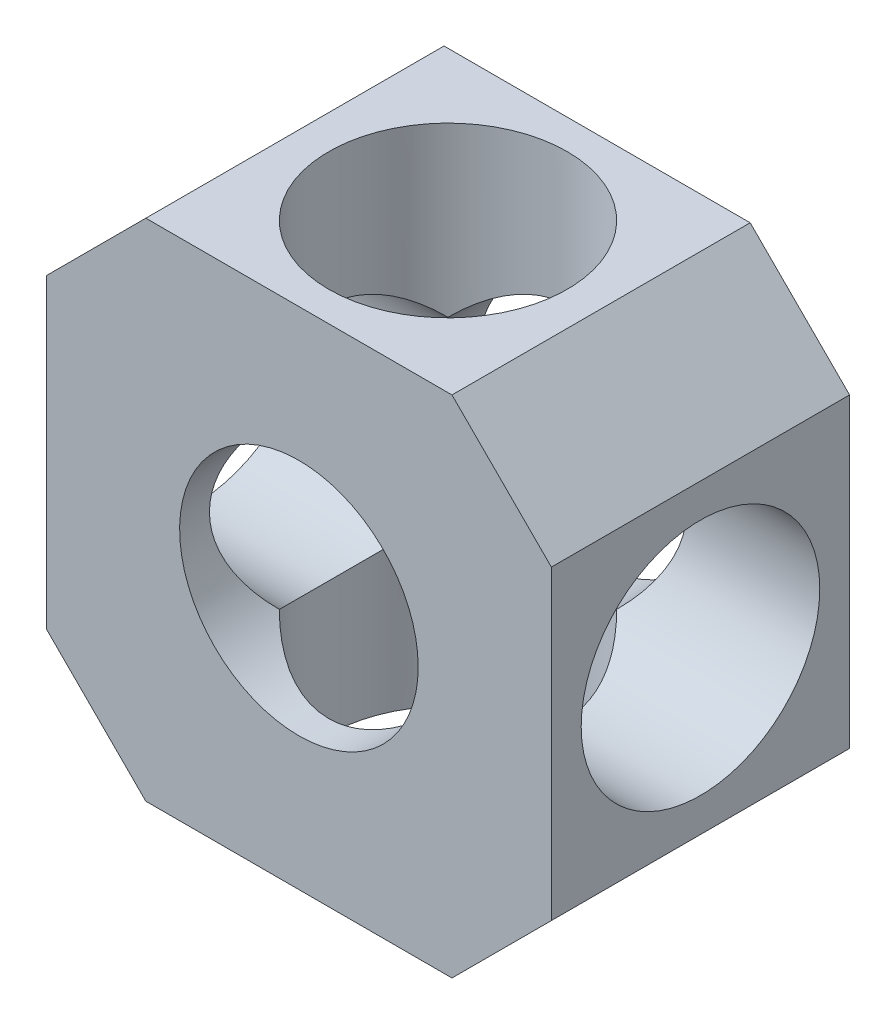
ISO-10303-21;
HEADER;
FILE_DESCRIPTION(('STEP AP214'),'2;1');
FILE_NAME('part.step','',(''),(''),'','','');
FILE_SCHEMA(('AUTOMOTIVE_DESIGN { 1 0 10303 214 1 1 1 1 }'));
ENDSEC;
DATA;
#1=APPLICATION_CONTEXT('core data for automotive mechanical design processes');
#2=APPLICATION_PROTOCOL_DEFINITION('international standard','automotive_design',2000,#1);
#3=PRODUCT_CONTEXT('',#1,'mechanical');
#4=PRODUCT('Part','Part','',(#3));
#5=PRODUCT_RELATED_PRODUCT_CATEGORY('part','',(#4));
#6=PRODUCT_DEFINITION_FORMATION('','',#4);
#7=PRODUCT_DEFINITION_CONTEXT('part definition',#1,'design');
#8=PRODUCT_DEFINITION('design','',#6,#7);
#9=PRODUCT_DEFINITION_SHAPE('','',#8);
#10=(LENGTH_UNIT() NAMED_UNIT(*) SI_UNIT(.MILLI.,.METRE.));
#11=(NAMED_UNIT(*) PLANE_ANGLE_UNIT() SI_UNIT($,.RADIAN.));
#12=(NAMED_UNIT(*) SI_UNIT($,.STERADIAN.) SOLID_ANGLE_UNIT());
#13=UNCERTAINTY_MEASURE_WITH_UNIT(LENGTH_MEASURE(1.E-05),#10,'distance_accuracy_value','');
#14=(GEOMETRIC_REPRESENTATION_CONTEXT(3) GLOBAL_UNCERTAINTY_ASSIGNED_CONTEXT((#13)) GLOBAL_UNIT_ASSIGNED_CONTEXT((#10,
#11,#12)) REPRESENTATION_CONTEXT('',''));
#15=CARTESIAN_POINT('',(0.,0.,0.));
#16=DIRECTION('',(0.,0.,1.));
#17=DIRECTION('',(1.,0.,0.));
#18=AXIS2_PLACEMENT_3D('',#15,#16,#17);
#19=CARTESIAN_POINT('',(12.7,12.7,15.));
#20=DIRECTION('',(0.,0.,-1.));
#21=DIRECTION('',(-1.,0.,0.));
#22=AXIS2_PLACEMENT_3D('',#19,#20,#21);
#23=CYLINDRICAL_SURFACE('',#22,6.);
#24=CARTESIAN_POINT('',(12.7,12.7,7.5));
#25=DIRECTION('',(0.,0.707106781186547,-0.707106781186547));
#26=DIRECTION('',(0.,-0.707106781186547,-0.707106781186547));
#27=AXIS2_PLACEMENT_3D('',#24,#25,#26);
#28=ELLIPSE('',#27,8.48528137423857,6.);
#29=CARTESIAN_POINT('',(16.9426406871193,16.9426406871193,11.7426406871193));
#30=VERTEX_POINT('',#29);
#31=CARTESIAN_POINT('',(8.45735931288072,16.9426406871193,11.7426406871193));
#32=VERTEX_POINT('',#31);
#33=EDGE_CURVE('E127',#30,#32,#28,.F.);
#34=ORIENTED_EDGE('',*,*,#33,.F.);
#35=CARTESIAN_POINT('',(12.7,12.7,7.5));
#36=DIRECTION('',(0.707106781186547,0.,-0.707106781186547));
#37=DIRECTION('',(-0.707106781186547,0.,-0.707106781186547));
#38=AXIS2_PLACEMENT_3D('',#35,#36,#37);
#39=ELLIPSE('',#38,8.48528137423857,6.);
#40=CARTESIAN_POINT('',(16.9426406871193,8.45735931288072,11.7426406871193));
#41=VERTEX_POINT('',#40);
#42=EDGE_CURVE('E134',#41,#30,#39,.F.);
#43=ORIENTED_EDGE('',*,*,#42,.F.);
#44=CARTESIAN_POINT('',(12.7,12.7,7.5));
#45=DIRECTION('',(0.,-0.707106781186547,-0.707106781186547));
#46=DIRECTION('',(0.,0.707106781186547,-0.707106781186547));
#47=AXIS2_PLACEMENT_3D('',#44,#45,#46);
#48=ELLIPSE('',#47,8.48528137423857,6.);
#49=CARTESIAN_POINT('',(8.45735931288072,8.45735931288072,11.7426406871193));
#50=VERTEX_POINT('',#49);
#51=EDGE_CURVE('E63',#50,#41,#48,.F.);
#52=ORIENTED_EDGE('',*,*,#51,.F.);
#53=CARTESIAN_POINT('',(12.7,12.7,7.5));
#54=DIRECTION('',(-0.707106781186547,0.,-0.707106781186547));
#55=DIRECTION('',(0.707106781186547,0.,-0.707106781186547));
#56=AXIS2_PLACEMENT_3D('',#53,#54,#55);
#57=ELLIPSE('',#56,8.48528137423857,6.);
#58=EDGE_CURVE('E140',#32,#50,#57,.F.);
#59=ORIENTED_EDGE('',*,*,#58,.F.);
#60=EDGE_LOOP('',(#34,#43,#52,#59));
#61=FACE_BOUND('',#60,.T.);
#62=CARTESIAN_POINT('',(12.7,12.7,15.));
#63=DIRECTION('',(0.,0.,1.));
#64=DIRECTION('',(1.,0.,0.));
#65=AXIS2_PLACEMENT_3D('',#62,#63,#64);
#66=CIRCLE('',#65,6.);
#67=CARTESIAN_POINT('',(18.7,12.7,15.));
#68=VERTEX_POINT('',#67);
#69=EDGE_CURVE('E217',#68,#68,#66,.T.);
#70=ORIENTED_EDGE('',*,*,#69,.T.);
#71=EDGE_LOOP('',(#70));
#72=FACE_BOUND('',#71,.T.);
#73=ADVANCED_FACE('F39',(#61,#72),#23,.F.);
#74=CARTESIAN_POINT('',(0.,0.,15.));
#75=DIRECTION('',(0.,0.,-1.));
#76=DIRECTION('',(-1.,0.,0.));
#77=AXIS2_PLACEMENT_3D('',#74,#75,#76);
#78=PLANE('',#77);
#79=DIRECTION('',(0.,-1.,0.));
#80=VECTOR('',#79,1.);
#81=CARTESIAN_POINT('',(0.,5.,15.));
#82=LINE('',#81,#80);
#83=CARTESIAN_POINT('',(0.,20.4,15.));
#84=VERTEX_POINT('',#83);
#85=CARTESIAN_POINT('',(0.,5.,15.));
#86=VERTEX_POINT('',#85);
#87=EDGE_CURVE('E194',#84,#86,#82,.T.);
#88=ORIENTED_EDGE('',*,*,#87,.T.);
#89=DIRECTION('',(0.707106781186548,-0.707106781186548,0.));
#90=VECTOR('',#89,1.);
#91=CARTESIAN_POINT('',(0.,5.,15.));
#92=LINE('',#91,#90);
#93=CARTESIAN_POINT('',(5.,0.,15.));
#94=VERTEX_POINT('',#93);
#95=EDGE_CURVE('E235',#86,#94,#92,.T.);
#96=ORIENTED_EDGE('',*,*,#95,.T.);
#97=DIRECTION('',(1.,0.,0.));
#98=VECTOR('',#97,1.);
#99=CARTESIAN_POINT('',(5.,0.,15.));
#100=LINE('',#99,#98);
#101=CARTESIAN_POINT('',(20.4,0.,15.));
#102=VERTEX_POINT('',#101);
#103=EDGE_CURVE('E232',#94,#102,#100,.T.);
#104=ORIENTED_EDGE('',*,*,#103,.T.);
#105=DIRECTION('',(0.707106781186548,0.707106781186547,0.));
#106=VECTOR('',#105,1.);
#107=CARTESIAN_POINT('',(20.4,0.,15.));
#108=LINE('',#107,#106);
#109=CARTESIAN_POINT('',(25.4,5.,15.));
#110=VERTEX_POINT('',#109);
#111=EDGE_CURVE('E229',#102,#110,#108,.T.);
#112=ORIENTED_EDGE('',*,*,#111,.T.);
#113=DIRECTION('',(0.,1.,0.));
#114=VECTOR('',#113,1.);
#115=CARTESIAN_POINT('',(25.4,5.,15.));
#116=LINE('',#115,#114);
#117=CARTESIAN_POINT('',(25.4,20.4,15.));
#118=VERTEX_POINT('',#117);
#119=EDGE_CURVE('E226',#110,#118,#116,.T.);
#120=ORIENTED_EDGE('',*,*,#119,.T.);
#121=DIRECTION('',(-0.707106781186548,0.707106781186548,0.));
#122=VECTOR('',#121,1.);
#123=CARTESIAN_POINT('',(20.4,25.4,15.));
#124=LINE('',#123,#122);
#125=CARTESIAN_POINT('',(20.4,25.4,15.));
#126=VERTEX_POINT('',#125);
#127=EDGE_CURVE('E223',#118,#126,#124,.T.);
#128=ORIENTED_EDGE('',*,*,#127,.T.);
#129=DIRECTION('',(-1.,0.,0.));
#130=VECTOR('',#129,1.);
#131=CARTESIAN_POINT('',(5.,25.4,15.));
#132=LINE('',#131,#130);
#133=CARTESIAN_POINT('',(5.,25.4,15.));
#134=VERTEX_POINT('',#133);
#135=EDGE_CURVE('E220',#126,#134,#132,.T.);
#136=ORIENTED_EDGE('',*,*,#135,.T.);
#137=DIRECTION('',(-0.707106781186547,-0.707106781186548,0.));
#138=VECTOR('',#137,1.);
#139=CARTESIAN_POINT('',(0.,20.4,15.));
#140=LINE('',#139,#138);
#141=EDGE_CURVE('E190',#134,#84,#140,.T.);
#142=ORIENTED_EDGE('',*,*,#141,.T.);
#143=EDGE_LOOP('',(#88,#96,#104,#112,#120,#128,#136,#142));
#144=FACE_BOUND('',#143,.T.);
#145=ORIENTED_EDGE('',*,*,#69,.F.);
#146=EDGE_LOOP('',(#145));
#147=FACE_BOUND('',#146,.T.);
#148=ADVANCED_FACE('F303',(#144,#147),#78,.F.);
#149=CARTESIAN_POINT('',(0.,0.,0.));
#150=DIRECTION('',(0.,0.,-1.));
#151=DIRECTION('',(-1.,0.,0.));
#152=AXIS2_PLACEMENT_3D('',#149,#150,#151);
#153=PLANE('',#152);
#154=DIRECTION('',(0.,-1.,0.));
#155=VECTOR('',#154,1.);
#156=CARTESIAN_POINT('',(0.,5.,0.));
#157=LINE('',#156,#155);
#158=CARTESIAN_POINT('',(0.,20.4,0.));
#159=VERTEX_POINT('',#158);
#160=CARTESIAN_POINT('',(0.,5.,0.));
#161=VERTEX_POINT('',#160);
#162=EDGE_CURVE('E213',#159,#161,#157,.T.);
#163=ORIENTED_EDGE('',*,*,#162,.F.);
#164=DIRECTION('',(-0.707106781186547,-0.707106781186548,0.));
#165=VECTOR('',#164,1.);
#166=CARTESIAN_POINT('',(0.,20.4,0.));
#167=LINE('',#166,#165);
#168=CARTESIAN_POINT('',(5.,25.4,0.));
#169=VERTEX_POINT('',#168);
#170=EDGE_CURVE('E191',#169,#159,#167,.T.);
#171=ORIENTED_EDGE('',*,*,#170,.F.);
#172=DIRECTION('',(-1.,0.,0.));
#173=VECTOR('',#172,1.);
#174=CARTESIAN_POINT('',(5.,25.4,0.));
#175=LINE('',#174,#173);
#176=CARTESIAN_POINT('',(20.4,25.4,0.));
#177=VERTEX_POINT('',#176);
#178=EDGE_CURVE('E195',#177,#169,#175,.T.);
#179=ORIENTED_EDGE('',*,*,#178,.F.);
#180=DIRECTION('',(-0.707106781186548,0.707106781186548,0.));
#181=VECTOR('',#180,1.);
#182=CARTESIAN_POINT('',(20.4,25.4,0.));
#183=LINE('',#182,#181);
#184=CARTESIAN_POINT('',(25.4,20.4,0.));
#185=VERTEX_POINT('',#184);
#186=EDGE_CURVE('E198',#185,#177,#183,.T.);
#187=ORIENTED_EDGE('',*,*,#186,.F.);
#188=DIRECTION('',(0.,1.,0.));
#189=VECTOR('',#188,1.);
#190=CARTESIAN_POINT('',(25.4,5.,0.));
#191=LINE('',#190,#189);
#192=CARTESIAN_POINT('',(25.4,5.,0.));
#193=VERTEX_POINT('',#192);
#194=EDGE_CURVE('E201',#193,#185,#191,.T.);
#195=ORIENTED_EDGE('',*,*,#194,.F.);
#196=DIRECTION('',(0.707106781186548,0.707106781186547,0.));
#197=VECTOR('',#196,1.);
#198=CARTESIAN_POINT('',(20.4,0.,0.));
#199=LINE('',#198,#197);
#200=CARTESIAN_POINT('',(20.4,0.,0.));
#201=VERTEX_POINT('',#200);
#202=EDGE_CURVE('E204',#201,#193,#199,.T.);
#203=ORIENTED_EDGE('',*,*,#202,.F.);
#204=DIRECTION('',(1.,0.,0.));
#205=VECTOR('',#204,1.);
#206=CARTESIAN_POINT('',(5.,0.,0.));
#207=LINE('',#206,#205);
#208=CARTESIAN_POINT('',(5.,0.,0.));
#209=VERTEX_POINT('',#208);
#210=EDGE_CURVE('E207',#209,#201,#207,.T.);
#211=ORIENTED_EDGE('',*,*,#210,.F.);
#212=DIRECTION('',(0.707106781186548,-0.707106781186548,0.));
#213=VECTOR('',#212,1.);
#214=CARTESIAN_POINT('',(0.,5.,0.));
#215=LINE('',#214,#213);
#216=EDGE_CURVE('E210',#161,#209,#215,.T.);
#217=ORIENTED_EDGE('',*,*,#216,.F.);
#218=EDGE_LOOP('',(#163,#171,#179,#187,#195,#203,#211,#217));
#219=FACE_BOUND('',#218,.T.);
#220=CARTESIAN_POINT('',(12.7,12.7,0.));
#221=DIRECTION('',(0.,0.,1.));
#222=DIRECTION('',(1.,0.,0.));
#223=AXIS2_PLACEMENT_3D('',#220,#221,#222);
#224=CIRCLE('',#223,6.);
#225=CARTESIAN_POINT('',(18.7,12.7,0.));
#226=VERTEX_POINT('',#225);
#227=EDGE_CURVE('E241',#226,#226,#224,.T.);
#228=ORIENTED_EDGE('',*,*,#227,.T.);
#229=EDGE_LOOP('',(#228));
#230=FACE_BOUND('',#229,.T.);
#231=ADVANCED_FACE('F296',(#219,#230),#153,.T.);
#232=CARTESIAN_POINT('',(0.,5.,15.));
#233=DIRECTION('',(1.,0.,0.));
#234=DIRECTION('',(0.,0.,-1.));
#235=AXIS2_PLACEMENT_3D('',#232,#233,#234);
#236=PLANE('',#235);
#237=CARTESIAN_POINT('',(0.,12.7,7.5));
#238=DIRECTION('',(1.,0.,0.));
#239=DIRECTION('',(0.,0.,-1.));
#240=AXIS2_PLACEMENT_3D('',#237,#238,#239);
#241=CIRCLE('',#240,6.);
#242=CARTESIAN_POINT('',(0.,12.7,1.5));
#243=VERTEX_POINT('',#242);
#244=EDGE_CURVE('E245',#243,#243,#241,.T.);
#245=ORIENTED_EDGE('',*,*,#244,.T.);
#246=EDGE_LOOP('',(#245));
#247=FACE_BOUND('',#246,.T.);
#248=ORIENTED_EDGE('',*,*,#162,.T.);
#249=DIRECTION('',(0.,0.,-1.));
#250=VECTOR('',#249,1.);
#251=CARTESIAN_POINT('',(0.,5.,15.));
#252=LINE('',#251,#250);
#253=EDGE_CURVE('E158',#86,#161,#252,.T.);
#254=ORIENTED_EDGE('',*,*,#253,.F.);
#255=ORIENTED_EDGE('',*,*,#87,.F.);
#256=DIRECTION('',(0.,0.,-1.));
#257=VECTOR('',#256,1.);
#258=CARTESIAN_POINT('',(0.,20.4,15.));
#259=LINE('',#258,#257);
#260=EDGE_CURVE('E186',#84,#159,#259,.T.);
#261=ORIENTED_EDGE('',*,*,#260,.T.);
#262=EDGE_LOOP('',(#248,#254,#255,#261));
#263=FACE_BOUND('',#262,.T.);
#264=ADVANCED_FACE('F41',(#247,#263),#236,.F.);
#265=CARTESIAN_POINT('',(0.,5.,15.));
#266=DIRECTION('',(0.707106781186547,0.707106781186547,0.));
#267=DIRECTION('',(-0.707106781186548,0.707106781186548,0.));
#268=AXIS2_PLACEMENT_3D('',#265,#266,#267);
#269=PLANE('',#268);
#270=ORIENTED_EDGE('',*,*,#216,.T.);
#271=DIRECTION('',(0.,0.,-1.));
#272=VECTOR('',#271,1.);
#273=CARTESIAN_POINT('',(5.,0.,15.));
#274=LINE('',#273,#272);
#275=EDGE_CURVE('E162',#94,#209,#274,.T.);
#276=ORIENTED_EDGE('',*,*,#275,.F.);
#277=ORIENTED_EDGE('',*,*,#95,.F.);
#278=ORIENTED_EDGE('',*,*,#253,.T.);
#279=EDGE_LOOP('',(#270,#276,#277,#278));
#280=FACE_BOUND('',#279,.T.);
#281=ADVANCED_FACE('F323',(#280),#269,.F.);
#282=CARTESIAN_POINT('',(5.,0.,15.));
#283=DIRECTION('',(0.,1.,0.));
#284=DIRECTION('',(0.,0.,1.));
#285=AXIS2_PLACEMENT_3D('',#282,#283,#284);
#286=PLANE('',#285);
#287=CARTESIAN_POINT('',(12.7,0.,7.5));
#288=DIRECTION('',(0.,1.,0.));
#289=DIRECTION('',(0.,0.,1.));
#290=AXIS2_PLACEMENT_3D('',#287,#288,#289);
#291=CIRCLE('',#290,6.);
#292=CARTESIAN_POINT('',(12.7,0.,13.5));
#293=VERTEX_POINT('',#292);
#294=EDGE_CURVE('E256',#293,#293,#291,.T.);
#295=ORIENTED_EDGE('',*,*,#294,.T.);
#296=EDGE_LOOP('',(#295));
#297=FACE_BOUND('',#296,.T.);
#298=ORIENTED_EDGE('',*,*,#210,.T.);
#299=DIRECTION('',(0.,0.,-1.));
#300=VECTOR('',#299,1.);
#301=CARTESIAN_POINT('',(20.4,0.,15.));
#302=LINE('',#301,#300);
#303=EDGE_CURVE('E166',#102,#201,#302,.T.);
#304=ORIENTED_EDGE('',*,*,#303,.F.);
#305=ORIENTED_EDGE('',*,*,#103,.F.);
#306=ORIENTED_EDGE('',*,*,#275,.T.);
#307=EDGE_LOOP('',(#298,#304,#305,#306));
#308=FACE_BOUND('',#307,.T.);
#309=ADVANCED_FACE('F321',(#297,#308),#286,.F.);
#310=CARTESIAN_POINT('',(20.4,0.,15.));
#311=DIRECTION('',(-0.707106781186547,0.707106781186548,0.));
#312=DIRECTION('',(-0.707106781186548,-0.707106781186547,0.));
#313=AXIS2_PLACEMENT_3D('',#310,#311,#312);
#314=PLANE('',#313);
#315=ORIENTED_EDGE('',*,*,#202,.T.);
#316=DIRECTION('',(0.,0.,-1.));
#317=VECTOR('',#316,1.);
#318=CARTESIAN_POINT('',(25.4,5.,15.));
#319=LINE('',#318,#317);
#320=EDGE_CURVE('E170',#110,#193,#319,.T.);
#321=ORIENTED_EDGE('',*,*,#320,.F.);
#322=ORIENTED_EDGE('',*,*,#111,.F.);
#323=ORIENTED_EDGE('',*,*,#303,.T.);
#324=EDGE_LOOP('',(#315,#321,#322,#323));
#325=FACE_BOUND('',#324,.T.);
#326=ADVANCED_FACE('F317',(#325),#314,.F.);
#327=CARTESIAN_POINT('',(25.4,5.,15.));
#328=DIRECTION('',(-1.,0.,0.));
#329=DIRECTION('',(0.,0.,1.));
#330=AXIS2_PLACEMENT_3D('',#327,#328,#329);
#331=PLANE('',#330);
#332=CARTESIAN_POINT('',(25.4,12.7,7.5));
#333=DIRECTION('',(1.,0.,0.));
#334=DIRECTION('',(0.,0.,-1.));
#335=AXIS2_PLACEMENT_3D('',#332,#333,#334);
#336=CIRCLE('',#335,6.);
#337=CARTESIAN_POINT('',(25.4,12.7,1.5));
#338=VERTEX_POINT('',#337);
#339=EDGE_CURVE('E252',#338,#338,#336,.T.);
#340=ORIENTED_EDGE('',*,*,#339,.F.);
#341=EDGE_LOOP('',(#340));
#342=FACE_BOUND('',#341,.T.);
#343=ORIENTED_EDGE('',*,*,#194,.T.);
#344=DIRECTION('',(0.,0.,-1.));
#345=VECTOR('',#344,1.);
#346=CARTESIAN_POINT('',(25.4,20.4,15.));
#347=LINE('',#346,#345);
#348=EDGE_CURVE('E174',#118,#185,#347,.T.);
#349=ORIENTED_EDGE('',*,*,#348,.F.);
#350=ORIENTED_EDGE('',*,*,#119,.F.);
#351=ORIENTED_EDGE('',*,*,#320,.T.);
#352=EDGE_LOOP('',(#343,#349,#350,#351));
#353=FACE_BOUND('',#352,.T.);
#354=ADVANCED_FACE('F313',(#342,#353),#331,.F.);
#355=CARTESIAN_POINT('',(20.4,25.4,15.));
#356=DIRECTION('',(-0.707106781186547,-0.707106781186547,0.));
#357=DIRECTION('',(0.707106781186548,-0.707106781186548,0.));
#358=AXIS2_PLACEMENT_3D('',#355,#356,#357);
#359=PLANE('',#358);
#360=ORIENTED_EDGE('',*,*,#186,.T.);
#361=DIRECTION('',(0.,0.,-1.));
#362=VECTOR('',#361,1.);
#363=CARTESIAN_POINT('',(20.4,25.4,15.));
#364=LINE('',#363,#362);
#365=EDGE_CURVE('E178',#126,#177,#364,.T.);
#366=ORIENTED_EDGE('',*,*,#365,.F.);
#367=ORIENTED_EDGE('',*,*,#127,.F.);
#368=ORIENTED_EDGE('',*,*,#348,.T.);
#369=EDGE_LOOP('',(#360,#366,#367,#368));
#370=FACE_BOUND('',#369,.T.);
#371=ADVANCED_FACE('F283',(#370),#359,.F.);
#372=CARTESIAN_POINT('',(5.,25.4,15.));
#373=DIRECTION('',(0.,-1.,0.));
#374=DIRECTION('',(0.,0.,-1.));
#375=AXIS2_PLACEMENT_3D('',#372,#373,#374);
#376=PLANE('',#375);
#377=CARTESIAN_POINT('',(12.7,25.4,7.5));
#378=DIRECTION('',(0.,1.,0.));
#379=DIRECTION('',(0.,0.,1.));
#380=AXIS2_PLACEMENT_3D('',#377,#378,#379);
#381=CIRCLE('',#380,6.);
#382=CARTESIAN_POINT('',(12.7,25.4,13.5));
#383=VERTEX_POINT('',#382);
#384=EDGE_CURVE('E273',#383,#383,#381,.T.);
#385=ORIENTED_EDGE('',*,*,#384,.F.);
#386=EDGE_LOOP('',(#385));
#387=FACE_BOUND('',#386,.T.);
#388=ORIENTED_EDGE('',*,*,#178,.T.);
#389=DIRECTION('',(0.,0.,-1.));
#390=VECTOR('',#389,1.);
#391=CARTESIAN_POINT('',(5.,25.4,15.));
#392=LINE('',#391,#390);
#393=EDGE_CURVE('E182',#134,#169,#392,.T.);
#394=ORIENTED_EDGE('',*,*,#393,.F.);
#395=ORIENTED_EDGE('',*,*,#135,.F.);
#396=ORIENTED_EDGE('',*,*,#365,.T.);
#397=EDGE_LOOP('',(#388,#394,#395,#396));
#398=FACE_BOUND('',#397,.T.);
#399=ADVANCED_FACE('F279',(#387,#398),#376,.F.);
#400=CARTESIAN_POINT('',(0.,20.4,15.));
#401=DIRECTION('',(0.707106781186548,-0.707106781186547,0.));
#402=DIRECTION('',(0.707106781186547,0.707106781186548,0.));
#403=AXIS2_PLACEMENT_3D('',#400,#401,#402);
#404=PLANE('',#403);
#405=ORIENTED_EDGE('',*,*,#170,.T.);
#406=ORIENTED_EDGE('',*,*,#260,.F.);
#407=ORIENTED_EDGE('',*,*,#141,.F.);
#408=ORIENTED_EDGE('',*,*,#393,.T.);
#409=EDGE_LOOP('',(#405,#406,#407,#408));
#410=FACE_BOUND('',#409,.T.);
#411=ADVANCED_FACE('F282',(#410),#404,.F.);
#412=CARTESIAN_POINT('',(12.7,12.7,7.5));
#413=DIRECTION('',(0.,0.707106781186547,-0.707106781186547));
#414=DIRECTION('',(0.,-0.707106781186547,-0.707106781186547));
#415=AXIS2_PLACEMENT_3D('',#412,#413,#414);
#416=ELLIPSE('',#415,8.48528137423857,6.);
#417=CARTESIAN_POINT('',(16.9426406871193,8.45735931288072,3.25735931288072));
#418=VERTEX_POINT('',#417);
#419=CARTESIAN_POINT('',(8.45735931288072,8.45735931288072,3.25735931288072));
#420=VERTEX_POINT('',#419);
#421=EDGE_CURVE('E266',#418,#420,#416,.T.);
#422=ORIENTED_EDGE('',*,*,#421,.F.);
#423=CARTESIAN_POINT('',(12.7,12.7,7.5));
#424=DIRECTION('',(-0.707106781186547,0.,-0.707106781186547));
#425=DIRECTION('',(0.707106781186547,0.,-0.707106781186547));
#426=AXIS2_PLACEMENT_3D('',#423,#424,#425);
#427=ELLIPSE('',#426,8.48528137423857,6.);
#428=CARTESIAN_POINT('',(16.9426406871193,16.9426406871193,3.25735931288072));
#429=VERTEX_POINT('',#428);
#430=EDGE_CURVE('E151',#429,#418,#427,.T.);
#431=ORIENTED_EDGE('',*,*,#430,.F.);
#432=CARTESIAN_POINT('',(12.7,12.7,7.5));
#433=DIRECTION('',(0.,-0.707106781186547,-0.707106781186547));
#434=DIRECTION('',(0.,0.707106781186547,-0.707106781186547));
#435=AXIS2_PLACEMENT_3D('',#432,#433,#434);
#436=ELLIPSE('',#435,8.48528137423857,6.);
#437=CARTESIAN_POINT('',(8.45735931288072,16.9426406871193,3.25735931288072));
#438=VERTEX_POINT('',#437);
#439=EDGE_CURVE('E55',#438,#429,#436,.T.);
#440=ORIENTED_EDGE('',*,*,#439,.F.);
#441=CARTESIAN_POINT('',(12.7,12.7,7.5));
#442=DIRECTION('',(0.707106781186547,0.,-0.707106781186547));
#443=DIRECTION('',(-0.707106781186547,0.,-0.707106781186547));
#444=AXIS2_PLACEMENT_3D('',#441,#442,#443);
#445=ELLIPSE('',#444,8.48528137423857,6.);
#446=EDGE_CURVE('E147',#420,#438,#445,.T.);
#447=ORIENTED_EDGE('',*,*,#446,.F.);
#448=EDGE_LOOP('',(#422,#431,#440,#447));
#449=FACE_BOUND('',#448,.T.);
#450=ORIENTED_EDGE('',*,*,#227,.F.);
#451=EDGE_LOOP('',(#450));
#452=FACE_BOUND('',#451,.T.);
#453=ADVANCED_FACE('F334',(#449,#452),#23,.F.);
#454=CARTESIAN_POINT('',(-1.60000000000001,12.7,7.5));
#455=DIRECTION('',(1.,0.,0.));
#456=DIRECTION('',(0.,0.,-1.));
#457=AXIS2_PLACEMENT_3D('',#454,#455,#456);
#458=CYLINDRICAL_SURFACE('',#457,6.);
#459=ORIENTED_EDGE('',*,*,#446,.T.);
#460=CARTESIAN_POINT('',(12.7,12.7,7.5));
#461=DIRECTION('',(0.707106781186547,0.707106781186547,0.));
#462=DIRECTION('',(0.707106781186547,-0.707106781186547,0.));
#463=AXIS2_PLACEMENT_3D('',#460,#461,#462);
#464=ELLIPSE('',#463,8.48528137423857,6.);
#465=EDGE_CURVE('E142',#438,#32,#464,.T.);
#466=ORIENTED_EDGE('',*,*,#465,.T.);
#467=ORIENTED_EDGE('',*,*,#58,.T.);
#468=CARTESIAN_POINT('',(12.7,12.7,7.5));
#469=DIRECTION('',(0.707106781186547,-0.707106781186547,0.));
#470=DIRECTION('',(0.707106781186547,0.707106781186547,0.));
#471=AXIS2_PLACEMENT_3D('',#468,#469,#470);
#472=ELLIPSE('',#471,8.48528137423857,6.);
#473=EDGE_CURVE('E260',#50,#420,#472,.T.);
#474=ORIENTED_EDGE('',*,*,#473,.T.);
#475=EDGE_LOOP('',(#459,#466,#467,#474));
#476=FACE_BOUND('',#475,.T.);
#477=ORIENTED_EDGE('',*,*,#244,.F.);
#478=EDGE_LOOP('',(#477));
#479=FACE_BOUND('',#478,.T.);
#480=ADVANCED_FACE('F341',(#476,#479),#458,.F.);
#481=ORIENTED_EDGE('',*,*,#430,.T.);
#482=CARTESIAN_POINT('',(12.7,12.7,7.5));
#483=DIRECTION('',(0.707106781186547,0.707106781186547,0.));
#484=DIRECTION('',(0.707106781186547,-0.707106781186547,0.));
#485=AXIS2_PLACEMENT_3D('',#482,#483,#484);
#486=ELLIPSE('',#485,8.48528137423857,6.);
#487=EDGE_CURVE('E11',#418,#41,#486,.F.);
#488=ORIENTED_EDGE('',*,*,#487,.T.);
#489=ORIENTED_EDGE('',*,*,#42,.T.);
#490=CARTESIAN_POINT('',(12.7,12.7,7.5));
#491=DIRECTION('',(0.707106781186547,-0.707106781186547,0.));
#492=DIRECTION('',(0.707106781186547,0.707106781186547,0.));
#493=AXIS2_PLACEMENT_3D('',#490,#491,#492);
#494=ELLIPSE('',#493,8.48528137423857,6.);
#495=EDGE_CURVE('E48',#30,#429,#494,.F.);
#496=ORIENTED_EDGE('',*,*,#495,.T.);
#497=EDGE_LOOP('',(#481,#488,#489,#496));
#498=FACE_BOUND('',#497,.T.);
#499=ORIENTED_EDGE('',*,*,#339,.T.);
#500=EDGE_LOOP('',(#499));
#501=FACE_BOUND('',#500,.T.);
#502=ADVANCED_FACE('F144',(#498,#501),#458,.F.);
#503=CARTESIAN_POINT('',(12.7,-1.60000000000001,7.5));
#504=DIRECTION('',(0.,1.,0.));
#505=DIRECTION('',(0.,0.,1.));
#506=AXIS2_PLACEMENT_3D('',#503,#504,#505);
#507=CYLINDRICAL_SURFACE('',#506,6.);
#508=ORIENTED_EDGE('',*,*,#384,.T.);
#509=EDGE_LOOP('',(#508));
#510=FACE_BOUND('',#509,.T.);
#511=ORIENTED_EDGE('',*,*,#439,.T.);
#512=ORIENTED_EDGE('',*,*,#495,.F.);
#513=ORIENTED_EDGE('',*,*,#33,.T.);
#514=ORIENTED_EDGE('',*,*,#465,.F.);
#515=EDGE_LOOP('',(#511,#512,#513,#514));
#516=FACE_BOUND('',#515,.T.);
#517=ADVANCED_FACE('F126',(#510,#516),#507,.F.);
#518=ORIENTED_EDGE('',*,*,#51,.T.);
#519=ORIENTED_EDGE('',*,*,#487,.F.);
#520=ORIENTED_EDGE('',*,*,#421,.T.);
#521=ORIENTED_EDGE('',*,*,#473,.F.);
#522=EDGE_LOOP('',(#518,#519,#520,#521));
#523=FACE_BOUND('',#522,.T.);
#524=ORIENTED_EDGE('',*,*,#294,.F.);
#525=EDGE_LOOP('',(#524));
#526=FACE_BOUND('',#525,.T.);
#527=ADVANCED_FACE('F438',(#523,#526),#507,.F.);
#528=CLOSED_SHELL('',(#73,#148,#231,#264,#281,#309,#326,#354,#371,#399,#411,#453,#480,#502,#517,#527));
#529=MANIFOLD_SOLID_BREP('B2',#528);
#530=ADVANCED_BREP_SHAPE_REPRESENTATION('',(#18,#529),#14);
#531=SHAPE_DEFINITION_REPRESENTATION(#9,#530);
ENDSEC;
END-ISO-10303-21;
